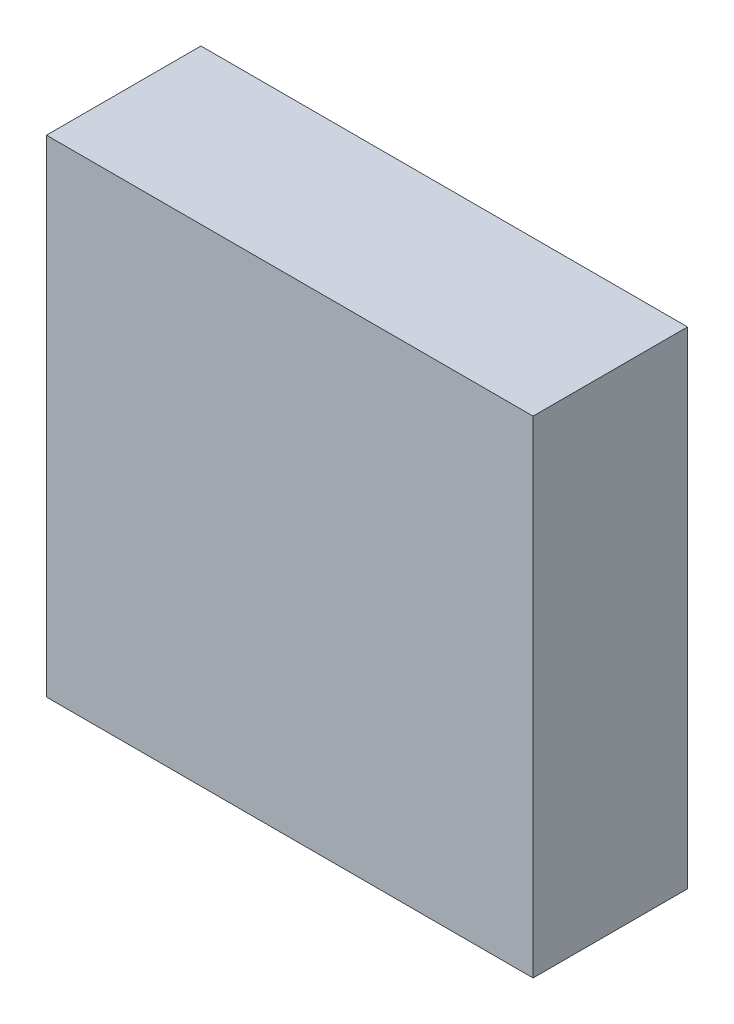
ISO-10303-21;
HEADER;
FILE_DESCRIPTION(('STEP AP214'),'2;1');
FILE_NAME('part.step','',(''),(''),'','','');
FILE_SCHEMA(('AUTOMOTIVE_DESIGN { 1 0 10303 214 1 1 1 1 }'));
ENDSEC;
DATA;
#1=APPLICATION_CONTEXT('core data for automotive mechanical design processes');
#2=APPLICATION_PROTOCOL_DEFINITION('international standard','automotive_design',2000,#1);
#3=PRODUCT_CONTEXT('',#1,'mechanical');
#4=PRODUCT('Part','Part','',(#3));
#5=PRODUCT_RELATED_PRODUCT_CATEGORY('part','',(#4));
#6=PRODUCT_DEFINITION_FORMATION('','',#4);
#7=PRODUCT_DEFINITION_CONTEXT('part definition',#1,'design');
#8=PRODUCT_DEFINITION('design','',#6,#7);
#9=PRODUCT_DEFINITION_SHAPE('','',#8);
#10=(LENGTH_UNIT() NAMED_UNIT(*) SI_UNIT(.MILLI.,.METRE.));
#11=(NAMED_UNIT(*) PLANE_ANGLE_UNIT() SI_UNIT($,.RADIAN.));
#12=(NAMED_UNIT(*) SI_UNIT($,.STERADIAN.) SOLID_ANGLE_UNIT());
#13=UNCERTAINTY_MEASURE_WITH_UNIT(LENGTH_MEASURE(1.E-05),#10,'distance_accuracy_value','');
#14=(GEOMETRIC_REPRESENTATION_CONTEXT(3) GLOBAL_UNCERTAINTY_ASSIGNED_CONTEXT((#13)) GLOBAL_UNIT_ASSIGNED_CONTEXT((#10,
#11,#12)) REPRESENTATION_CONTEXT('',''));
#15=CARTESIAN_POINT('',(0.,0.,0.));
#16=DIRECTION('',(0.,0.,1.));
#17=DIRECTION('',(1.,0.,0.));
#18=AXIS2_PLACEMENT_3D('',#15,#16,#17);
#19=CARTESIAN_POINT('',(1.57500066,1.57500066,1.00000054));
#20=DIRECTION('',(0.,0.,1.));
#21=DIRECTION('',(1.,0.,0.));
#22=AXIS2_PLACEMENT_3D('',#19,#20,#21);
#23=PLANE('',#22);
#24=DIRECTION('',(1.,0.,0.));
#25=VECTOR('',#24,1.);
#26=CARTESIAN_POINT('',(1.57500066,-1.57500066,1.00000054));
#27=LINE('',#26,#25);
#28=CARTESIAN_POINT('',(1.57500066,-1.57500066,1.00000054));
#29=VERTEX_POINT('',#28);
#30=CARTESIAN_POINT('',(-1.57500066,-1.57500066,1.00000054));
#31=VERTEX_POINT('',#30);
#32=EDGE_CURVE('E53',#29,#31,#27,.F.);
#33=ORIENTED_EDGE('',*,*,#32,.F.);
#34=DIRECTION('',(0.,1.,0.));
#35=VECTOR('',#34,1.);
#36=CARTESIAN_POINT('',(1.57500066,1.57500066,1.00000054));
#37=LINE('',#36,#35);
#38=CARTESIAN_POINT('',(1.57500066,1.57500066,1.00000054));
#39=VERTEX_POINT('',#38);
#40=EDGE_CURVE('E68',#39,#29,#37,.F.);
#41=ORIENTED_EDGE('',*,*,#40,.F.);
#42=DIRECTION('',(1.,0.,0.));
#43=VECTOR('',#42,1.);
#44=CARTESIAN_POINT('',(-1.57500066,1.57500066,1.00000054));
#45=LINE('',#44,#43);
#46=CARTESIAN_POINT('',(-1.57500066,1.57500066,1.00000054));
#47=VERTEX_POINT('',#46);
#48=EDGE_CURVE('E20',#47,#39,#45,.T.);
#49=ORIENTED_EDGE('',*,*,#48,.F.);
#50=DIRECTION('',(0.,1.,0.));
#51=VECTOR('',#50,1.);
#52=CARTESIAN_POINT('',(-1.57500066,-1.57500066,1.00000054));
#53=LINE('',#52,#51);
#54=EDGE_CURVE('E58',#31,#47,#53,.T.);
#55=ORIENTED_EDGE('',*,*,#54,.F.);
#56=EDGE_LOOP('',(#33,#41,#49,#55));
#57=FACE_BOUND('',#56,.T.);
#58=ADVANCED_FACE('F17',(#57),#23,.T.);
#59=CARTESIAN_POINT('',(-1.57500066,1.57500066,0.));
#60=DIRECTION('',(0.,1.,0.));
#61=DIRECTION('',(0.,0.,1.));
#62=AXIS2_PLACEMENT_3D('',#59,#60,#61);
#63=PLANE('',#62);
#64=DIRECTION('',(0.,0.,-1.));
#65=VECTOR('',#64,1.);
#66=CARTESIAN_POINT('',(1.57500066,1.57500066,0.));
#67=LINE('',#66,#65);
#68=CARTESIAN_POINT('',(1.57500066,1.57500066,0.));
#69=VERTEX_POINT('',#68);
#70=EDGE_CURVE('E79',#69,#39,#67,.F.);
#71=ORIENTED_EDGE('',*,*,#70,.F.);
#72=DIRECTION('',(1.,0.,0.));
#73=VECTOR('',#72,1.);
#74=CARTESIAN_POINT('',(1.57500066,1.57500066,0.));
#75=LINE('',#74,#73);
#76=CARTESIAN_POINT('',(-1.57500066,1.57500066,0.));
#77=VERTEX_POINT('',#76);
#78=EDGE_CURVE('E74',#69,#77,#75,.F.);
#79=ORIENTED_EDGE('',*,*,#78,.T.);
#80=DIRECTION('',(0.,0.,1.));
#81=VECTOR('',#80,1.);
#82=CARTESIAN_POINT('',(-1.57500066,1.57500066,0.));
#83=LINE('',#82,#81);
#84=EDGE_CURVE('E63',#47,#77,#83,.F.);
#85=ORIENTED_EDGE('',*,*,#84,.F.);
#86=ORIENTED_EDGE('',*,*,#48,.T.);
#87=EDGE_LOOP('',(#71,#79,#85,#86));
#88=FACE_BOUND('',#87,.T.);
#89=ADVANCED_FACE('F73',(#88),#63,.T.);
#90=CARTESIAN_POINT('',(-1.57500066,-1.57500066,0.));
#91=DIRECTION('',(-1.,0.,0.));
#92=DIRECTION('',(0.,0.,1.));
#93=AXIS2_PLACEMENT_3D('',#90,#91,#92);
#94=PLANE('',#93);
#95=ORIENTED_EDGE('',*,*,#84,.T.);
#96=DIRECTION('',(0.,1.,0.));
#97=VECTOR('',#96,1.);
#98=CARTESIAN_POINT('',(-1.57500066,1.57500066,0.));
#99=LINE('',#98,#97);
#100=CARTESIAN_POINT('',(-1.57500066,-1.57500066,0.));
#101=VERTEX_POINT('',#100);
#102=EDGE_CURVE('E84',#77,#101,#99,.F.);
#103=ORIENTED_EDGE('',*,*,#102,.T.);
#104=DIRECTION('',(0.,0.,-1.));
#105=VECTOR('',#104,1.);
#106=CARTESIAN_POINT('',(-1.57500066,-1.57500066,0.));
#107=LINE('',#106,#105);
#108=EDGE_CURVE('E65',#31,#101,#107,.T.);
#109=ORIENTED_EDGE('',*,*,#108,.F.);
#110=ORIENTED_EDGE('',*,*,#54,.T.);
#111=EDGE_LOOP('',(#95,#103,#109,#110));
#112=FACE_BOUND('',#111,.T.);
#113=ADVANCED_FACE('F60',(#112),#94,.T.);
#114=CARTESIAN_POINT('',(1.57500066,-1.57500066,0.));
#115=DIRECTION('',(0.,-1.,0.));
#116=DIRECTION('',(0.,0.,-1.));
#117=AXIS2_PLACEMENT_3D('',#114,#115,#116);
#118=PLANE('',#117);
#119=ORIENTED_EDGE('',*,*,#108,.T.);
#120=DIRECTION('',(1.,0.,0.));
#121=VECTOR('',#120,1.);
#122=CARTESIAN_POINT('',(1.57500066,-1.57500066,0.));
#123=LINE('',#122,#121);
#124=CARTESIAN_POINT('',(1.57500066,-1.57500066,0.));
#125=VERTEX_POINT('',#124);
#126=EDGE_CURVE('E26',#101,#125,#123,.T.);
#127=ORIENTED_EDGE('',*,*,#126,.T.);
#128=DIRECTION('',(0.,0.,-1.));
#129=VECTOR('',#128,1.);
#130=CARTESIAN_POINT('',(1.57500066,-1.57500066,0.));
#131=LINE('',#130,#129);
#132=EDGE_CURVE('E34',#29,#125,#131,.T.);
#133=ORIENTED_EDGE('',*,*,#132,.F.);
#134=ORIENTED_EDGE('',*,*,#32,.T.);
#135=EDGE_LOOP('',(#119,#127,#133,#134));
#136=FACE_BOUND('',#135,.T.);
#137=ADVANCED_FACE('F88',(#136),#118,.T.);
#138=CARTESIAN_POINT('',(1.57500066,1.57500066,0.));
#139=DIRECTION('',(1.,0.,0.));
#140=DIRECTION('',(0.,0.,-1.));
#141=AXIS2_PLACEMENT_3D('',#138,#139,#140);
#142=PLANE('',#141);
#143=ORIENTED_EDGE('',*,*,#132,.T.);
#144=DIRECTION('',(0.,1.,0.));
#145=VECTOR('',#144,1.);
#146=CARTESIAN_POINT('',(1.57500066,1.57500066,0.));
#147=LINE('',#146,#145);
#148=EDGE_CURVE('E11',#125,#69,#147,.T.);
#149=ORIENTED_EDGE('',*,*,#148,.T.);
#150=ORIENTED_EDGE('',*,*,#70,.T.);
#151=ORIENTED_EDGE('',*,*,#40,.T.);
#152=EDGE_LOOP('',(#143,#149,#150,#151));
#153=FACE_BOUND('',#152,.T.);
#154=ADVANCED_FACE('F91',(#153),#142,.T.);
#155=CARTESIAN_POINT('',(1.57500066,1.57500066,0.));
#156=DIRECTION('',(0.,0.,1.));
#157=DIRECTION('',(1.,0.,0.));
#158=AXIS2_PLACEMENT_3D('',#155,#156,#157);
#159=PLANE('',#158);
#160=ORIENTED_EDGE('',*,*,#126,.F.);
#161=ORIENTED_EDGE('',*,*,#102,.F.);
#162=ORIENTED_EDGE('',*,*,#78,.F.);
#163=ORIENTED_EDGE('',*,*,#148,.F.);
#164=EDGE_LOOP('',(#160,#161,#162,#163));
#165=FACE_BOUND('',#164,.T.);
#166=ADVANCED_FACE('F90',(#165),#159,.F.);
#167=CLOSED_SHELL('',(#58,#89,#113,#137,#154,#166));
#168=MANIFOLD_SOLID_BREP('B1',#167);
#169=ADVANCED_BREP_SHAPE_REPRESENTATION('',(#18,#168),#14);
#170=SHAPE_DEFINITION_REPRESENTATION(#9,#169);
ENDSEC;
END-ISO-10303-21;
